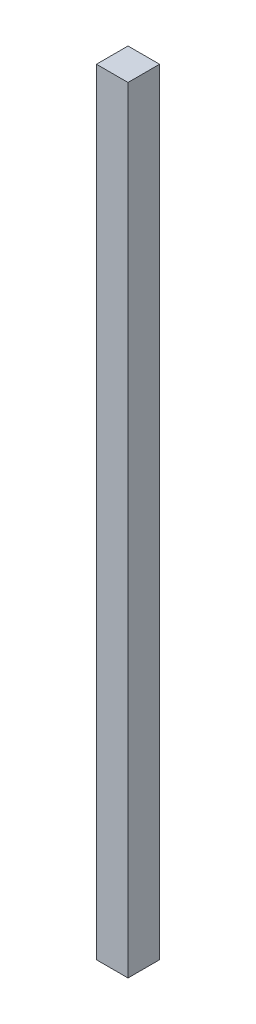
ISO-10303-21;
HEADER;
FILE_DESCRIPTION(('STEP AP214'),'2;1');
FILE_NAME('part.step','',(''),(''),'','','');
FILE_SCHEMA(('AUTOMOTIVE_DESIGN { 1 0 10303 214 1 1 1 1 }'));
ENDSEC;
DATA;
#1=APPLICATION_CONTEXT('core data for automotive mechanical design processes');
#2=APPLICATION_PROTOCOL_DEFINITION('international standard','automotive_design',2000,#1);
#3=PRODUCT_CONTEXT('',#1,'mechanical');
#4=PRODUCT('Part','Part','',(#3));
#5=PRODUCT_RELATED_PRODUCT_CATEGORY('part','',(#4));
#6=PRODUCT_DEFINITION_FORMATION('','',#4);
#7=PRODUCT_DEFINITION_CONTEXT('part definition',#1,'design');
#8=PRODUCT_DEFINITION('design','',#6,#7);
#9=PRODUCT_DEFINITION_SHAPE('','',#8);
#10=(LENGTH_UNIT() NAMED_UNIT(*) SI_UNIT(.MILLI.,.METRE.));
#11=(NAMED_UNIT(*) PLANE_ANGLE_UNIT() SI_UNIT($,.RADIAN.));
#12=(NAMED_UNIT(*) SI_UNIT($,.STERADIAN.) SOLID_ANGLE_UNIT());
#13=UNCERTAINTY_MEASURE_WITH_UNIT(LENGTH_MEASURE(1.E-05),#10,'distance_accuracy_value','');
#14=(GEOMETRIC_REPRESENTATION_CONTEXT(3) GLOBAL_UNCERTAINTY_ASSIGNED_CONTEXT((#13)) GLOBAL_UNIT_ASSIGNED_CONTEXT((#10,
#11,#12)) REPRESENTATION_CONTEXT('',''));
#15=CARTESIAN_POINT('',(0.,0.,0.));
#16=DIRECTION('',(0.,0.,1.));
#17=DIRECTION('',(1.,0.,0.));
#18=AXIS2_PLACEMENT_3D('',#15,#16,#17);
#19=CARTESIAN_POINT('',(5.7,280.,-5.7));
#20=DIRECTION('',(-1.,0.,0.));
#21=DIRECTION('',(0.,0.,1.));
#22=AXIS2_PLACEMENT_3D('',#19,#20,#21);
#23=PLANE('',#22);
#24=DIRECTION('',(0.,0.,-1.));
#25=VECTOR('',#24,1.);
#26=CARTESIAN_POINT('',(5.7,0.,-5.7));
#27=LINE('',#26,#25);
#28=CARTESIAN_POINT('',(5.7,0.,5.7));
#29=VERTEX_POINT('',#28);
#30=CARTESIAN_POINT('',(5.7,0.,-5.7));
#31=VERTEX_POINT('',#30);
#32=EDGE_CURVE('E94',#29,#31,#27,.T.);
#33=ORIENTED_EDGE('',*,*,#32,.T.);
#34=DIRECTION('',(0.,-1.,0.));
#35=VECTOR('',#34,1.);
#36=CARTESIAN_POINT('',(5.7,280.,-5.7));
#37=LINE('',#36,#35);
#38=CARTESIAN_POINT('',(5.7,280.,-5.7));
#39=VERTEX_POINT('',#38);
#40=EDGE_CURVE('E11',#39,#31,#37,.T.);
#41=ORIENTED_EDGE('',*,*,#40,.F.);
#42=DIRECTION('',(0.,0.,-1.));
#43=VECTOR('',#42,1.);
#44=CARTESIAN_POINT('',(5.7,280.,-5.7));
#45=LINE('',#44,#43);
#46=CARTESIAN_POINT('',(5.7,280.,5.7));
#47=VERTEX_POINT('',#46);
#48=EDGE_CURVE('E82',#47,#39,#45,.T.);
#49=ORIENTED_EDGE('',*,*,#48,.F.);
#50=DIRECTION('',(0.,-1.,0.));
#51=VECTOR('',#50,1.);
#52=CARTESIAN_POINT('',(5.7,280.,5.7));
#53=LINE('',#52,#51);
#54=EDGE_CURVE('E90',#47,#29,#53,.T.);
#55=ORIENTED_EDGE('',*,*,#54,.T.);
#56=EDGE_LOOP('',(#33,#41,#49,#55));
#57=FACE_BOUND('',#56,.T.);
#58=ADVANCED_FACE('F31',(#57),#23,.F.);
#59=CARTESIAN_POINT('',(-5.7,280.,-5.7));
#60=DIRECTION('',(0.,0.,1.));
#61=DIRECTION('',(1.,0.,0.));
#62=AXIS2_PLACEMENT_3D('',#59,#60,#61);
#63=PLANE('',#62);
#64=DIRECTION('',(-1.,0.,0.));
#65=VECTOR('',#64,1.);
#66=CARTESIAN_POINT('',(-5.7,0.,-5.7));
#67=LINE('',#66,#65);
#68=CARTESIAN_POINT('',(-5.7,0.,-5.7));
#69=VERTEX_POINT('',#68);
#70=EDGE_CURVE('E86',#31,#69,#67,.T.);
#71=ORIENTED_EDGE('',*,*,#70,.T.);
#72=DIRECTION('',(0.,-1.,0.));
#73=VECTOR('',#72,1.);
#74=CARTESIAN_POINT('',(-5.7,280.,-5.7));
#75=LINE('',#74,#73);
#76=CARTESIAN_POINT('',(-5.7,280.,-5.7));
#77=VERTEX_POINT('',#76);
#78=EDGE_CURVE('E39',#77,#69,#75,.T.);
#79=ORIENTED_EDGE('',*,*,#78,.F.);
#80=DIRECTION('',(-1.,0.,0.));
#81=VECTOR('',#80,1.);
#82=CARTESIAN_POINT('',(-5.7,280.,-5.7));
#83=LINE('',#82,#81);
#84=EDGE_CURVE('E77',#39,#77,#83,.T.);
#85=ORIENTED_EDGE('',*,*,#84,.F.);
#86=ORIENTED_EDGE('',*,*,#40,.T.);
#87=EDGE_LOOP('',(#71,#79,#85,#86));
#88=FACE_BOUND('',#87,.T.);
#89=ADVANCED_FACE('F85',(#88),#63,.F.);
#90=CARTESIAN_POINT('',(-5.7,280.,-5.7));
#91=DIRECTION('',(1.,0.,0.));
#92=DIRECTION('',(0.,0.,-1.));
#93=AXIS2_PLACEMENT_3D('',#90,#91,#92);
#94=PLANE('',#93);
#95=DIRECTION('',(0.,0.,1.));
#96=VECTOR('',#95,1.);
#97=CARTESIAN_POINT('',(-5.7,0.,-5.7));
#98=LINE('',#97,#96);
#99=CARTESIAN_POINT('',(-5.7,0.,5.7));
#100=VERTEX_POINT('',#99);
#101=EDGE_CURVE('E64',#69,#100,#98,.T.);
#102=ORIENTED_EDGE('',*,*,#101,.T.);
#103=DIRECTION('',(0.,-1.,0.));
#104=VECTOR('',#103,1.);
#105=CARTESIAN_POINT('',(-5.7,280.,5.7));
#106=LINE('',#105,#104);
#107=CARTESIAN_POINT('',(-5.7,280.,5.7));
#108=VERTEX_POINT('',#107);
#109=EDGE_CURVE('E87',#108,#100,#106,.T.);
#110=ORIENTED_EDGE('',*,*,#109,.F.);
#111=DIRECTION('',(0.,0.,1.));
#112=VECTOR('',#111,1.);
#113=CARTESIAN_POINT('',(-5.7,280.,-5.7));
#114=LINE('',#113,#112);
#115=EDGE_CURVE('E80',#77,#108,#114,.T.);
#116=ORIENTED_EDGE('',*,*,#115,.F.);
#117=ORIENTED_EDGE('',*,*,#78,.T.);
#118=EDGE_LOOP('',(#102,#110,#116,#117));
#119=FACE_BOUND('',#118,.T.);
#120=ADVANCED_FACE('F88',(#119),#94,.F.);
#121=CARTESIAN_POINT('',(-5.7,280.,5.7));
#122=DIRECTION('',(0.,0.,-1.));
#123=DIRECTION('',(-1.,0.,0.));
#124=AXIS2_PLACEMENT_3D('',#121,#122,#123);
#125=PLANE('',#124);
#126=DIRECTION('',(1.,0.,0.));
#127=VECTOR('',#126,1.);
#128=CARTESIAN_POINT('',(-5.7,0.,5.7));
#129=LINE('',#128,#127);
#130=EDGE_CURVE('E70',#100,#29,#129,.T.);
#131=ORIENTED_EDGE('',*,*,#130,.T.);
#132=ORIENTED_EDGE('',*,*,#54,.F.);
#133=DIRECTION('',(1.,0.,0.));
#134=VECTOR('',#133,1.);
#135=CARTESIAN_POINT('',(-5.7,280.,5.7));
#136=LINE('',#135,#134);
#137=EDGE_CURVE('E47',#108,#47,#136,.T.);
#138=ORIENTED_EDGE('',*,*,#137,.F.);
#139=ORIENTED_EDGE('',*,*,#109,.T.);
#140=EDGE_LOOP('',(#131,#132,#138,#139));
#141=FACE_BOUND('',#140,.T.);
#142=ADVANCED_FACE('F101',(#141),#125,.F.);
#143=CARTESIAN_POINT('',(5.7,280.,5.7));
#144=DIRECTION('',(0.,1.,0.));
#145=DIRECTION('',(0.,0.,1.));
#146=AXIS2_PLACEMENT_3D('',#143,#144,#145);
#147=PLANE('',#146);
#148=ORIENTED_EDGE('',*,*,#48,.T.);
#149=ORIENTED_EDGE('',*,*,#84,.T.);
#150=ORIENTED_EDGE('',*,*,#115,.T.);
#151=ORIENTED_EDGE('',*,*,#137,.T.);
#152=EDGE_LOOP('',(#148,#149,#150,#151));
#153=FACE_BOUND('',#152,.T.);
#154=ADVANCED_FACE('F78',(#153),#147,.T.);
#155=CARTESIAN_POINT('',(5.7,0.,5.7));
#156=DIRECTION('',(0.,1.,0.));
#157=DIRECTION('',(0.,0.,1.));
#158=AXIS2_PLACEMENT_3D('',#155,#156,#157);
#159=PLANE('',#158);
#160=ORIENTED_EDGE('',*,*,#32,.F.);
#161=ORIENTED_EDGE('',*,*,#130,.F.);
#162=ORIENTED_EDGE('',*,*,#101,.F.);
#163=ORIENTED_EDGE('',*,*,#70,.F.);
#164=EDGE_LOOP('',(#160,#161,#162,#163));
#165=FACE_BOUND('',#164,.T.);
#166=ADVANCED_FACE('F104',(#165),#159,.F.);
#167=CLOSED_SHELL('',(#58,#89,#120,#142,#154,#166));
#168=MANIFOLD_SOLID_BREP('B2',#167);
#169=ADVANCED_BREP_SHAPE_REPRESENTATION('',(#18,#168),#14);
#170=SHAPE_DEFINITION_REPRESENTATION(#9,#169);
ENDSEC;
END-ISO-10303-21;
